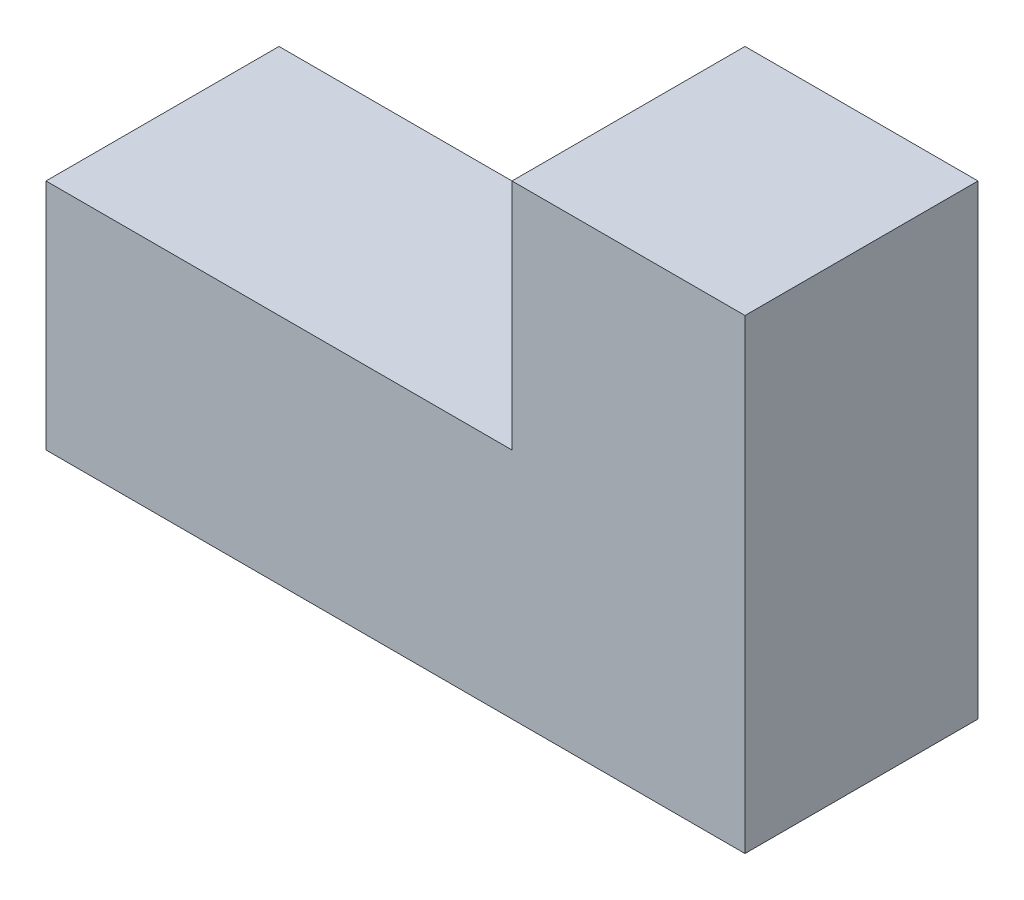
ISO-10303-21;
HEADER;
FILE_DESCRIPTION(('STEP AP214'),'2;1');
FILE_NAME('part.step','',(''),(''),'','','');
FILE_SCHEMA(('AUTOMOTIVE_DESIGN { 1 0 10303 214 1 1 1 1 }'));
ENDSEC;
DATA;
#1=APPLICATION_CONTEXT('core data for automotive mechanical design processes');
#2=APPLICATION_PROTOCOL_DEFINITION('international standard','automotive_design',2000,#1);
#3=PRODUCT_CONTEXT('',#1,'mechanical');
#4=PRODUCT('Part','Part','',(#3));
#5=PRODUCT_RELATED_PRODUCT_CATEGORY('part','',(#4));
#6=PRODUCT_DEFINITION_FORMATION('','',#4);
#7=PRODUCT_DEFINITION_CONTEXT('part definition',#1,'design');
#8=PRODUCT_DEFINITION('design','',#6,#7);
#9=PRODUCT_DEFINITION_SHAPE('','',#8);
#10=(LENGTH_UNIT() NAMED_UNIT(*) SI_UNIT(.MILLI.,.METRE.));
#11=(NAMED_UNIT(*) PLANE_ANGLE_UNIT() SI_UNIT($,.RADIAN.));
#12=(NAMED_UNIT(*) SI_UNIT($,.STERADIAN.) SOLID_ANGLE_UNIT());
#13=UNCERTAINTY_MEASURE_WITH_UNIT(LENGTH_MEASURE(1.E-05),#10,'distance_accuracy_value','');
#14=(GEOMETRIC_REPRESENTATION_CONTEXT(3) GLOBAL_UNCERTAINTY_ASSIGNED_CONTEXT((#13)) GLOBAL_UNIT_ASSIGNED_CONTEXT((#10,
#11,#12)) REPRESENTATION_CONTEXT('',''));
#15=CARTESIAN_POINT('',(0.,0.,0.));
#16=DIRECTION('',(0.,0.,1.));
#17=DIRECTION('',(1.,0.,0.));
#18=AXIS2_PLACEMENT_3D('',#15,#16,#17);
#19=CARTESIAN_POINT('',(-75.,30.,-30.));
#20=DIRECTION('',(-1.,0.,0.));
#21=DIRECTION('',(0.,0.,1.));
#22=AXIS2_PLACEMENT_3D('',#19,#20,#21);
#23=PLANE('',#22);
#24=DIRECTION('',(0.,-1.,0.));
#25=VECTOR('',#24,1.);
#26=CARTESIAN_POINT('',(-75.,30.,0.));
#27=LINE('',#26,#25);
#28=CARTESIAN_POINT('',(-75.,30.,0.));
#29=VERTEX_POINT('',#28);
#30=CARTESIAN_POINT('',(-75.,0.,0.));
#31=VERTEX_POINT('',#30);
#32=EDGE_CURVE('E118',#29,#31,#27,.T.);
#33=ORIENTED_EDGE('',*,*,#32,.F.);
#34=DIRECTION('',(0.,0.,1.));
#35=VECTOR('',#34,1.);
#36=CARTESIAN_POINT('',(-75.,30.,-30.));
#37=LINE('',#36,#35);
#38=CARTESIAN_POINT('',(-75.,30.,-30.));
#39=VERTEX_POINT('',#38);
#40=EDGE_CURVE('E11',#39,#29,#37,.T.);
#41=ORIENTED_EDGE('',*,*,#40,.F.);
#42=DIRECTION('',(0.,-1.,0.));
#43=VECTOR('',#42,1.);
#44=CARTESIAN_POINT('',(-75.,30.,-30.));
#45=LINE('',#44,#43);
#46=CARTESIAN_POINT('',(-75.,0.,-30.));
#47=VERTEX_POINT('',#46);
#48=EDGE_CURVE('E132',#39,#47,#45,.T.);
#49=ORIENTED_EDGE('',*,*,#48,.T.);
#50=DIRECTION('',(0.,0.,1.));
#51=VECTOR('',#50,1.);
#52=CARTESIAN_POINT('',(-75.,0.,-30.));
#53=LINE('',#52,#51);
#54=EDGE_CURVE('E36',#47,#31,#53,.T.);
#55=ORIENTED_EDGE('',*,*,#54,.T.);
#56=EDGE_LOOP('',(#33,#41,#49,#55));
#57=FACE_BOUND('',#56,.T.);
#58=ADVANCED_FACE('F33',(#57),#23,.T.);
#59=CARTESIAN_POINT('',(-15.,30.,-30.));
#60=DIRECTION('',(0.,1.,0.));
#61=DIRECTION('',(-1.,0.,0.));
#62=AXIS2_PLACEMENT_3D('',#59,#60,#61);
#63=PLANE('',#62);
#64=DIRECTION('',(-1.,0.,0.));
#65=VECTOR('',#64,1.);
#66=CARTESIAN_POINT('',(-15.,30.,0.));
#67=LINE('',#66,#65);
#68=CARTESIAN_POINT('',(-15.,30.,0.));
#69=VERTEX_POINT('',#68);
#70=EDGE_CURVE('E130',#69,#29,#67,.T.);
#71=ORIENTED_EDGE('',*,*,#70,.F.);
#72=DIRECTION('',(0.,0.,1.));
#73=VECTOR('',#72,1.);
#74=CARTESIAN_POINT('',(-15.,30.,-30.));
#75=LINE('',#74,#73);
#76=CARTESIAN_POINT('',(-15.,30.,-30.));
#77=VERTEX_POINT('',#76);
#78=EDGE_CURVE('E42',#77,#69,#75,.T.);
#79=ORIENTED_EDGE('',*,*,#78,.F.);
#80=DIRECTION('',(-1.,0.,0.));
#81=VECTOR('',#80,1.);
#82=CARTESIAN_POINT('',(-15.,30.,-30.));
#83=LINE('',#82,#81);
#84=EDGE_CURVE('E108',#77,#39,#83,.T.);
#85=ORIENTED_EDGE('',*,*,#84,.T.);
#86=ORIENTED_EDGE('',*,*,#40,.T.);
#87=EDGE_LOOP('',(#71,#79,#85,#86));
#88=FACE_BOUND('',#87,.T.);
#89=ADVANCED_FACE('F140',(#88),#63,.T.);
#90=CARTESIAN_POINT('',(-15.,60.,-30.));
#91=DIRECTION('',(-1.,0.,0.));
#92=DIRECTION('',(0.,-1.,0.));
#93=AXIS2_PLACEMENT_3D('',#90,#91,#92);
#94=PLANE('',#93);
#95=DIRECTION('',(0.,-1.,0.));
#96=VECTOR('',#95,1.);
#97=CARTESIAN_POINT('',(-15.,60.,0.));
#98=LINE('',#97,#96);
#99=CARTESIAN_POINT('',(-15.,60.,0.));
#100=VERTEX_POINT('',#99);
#101=EDGE_CURVE('E95',#100,#69,#98,.T.);
#102=ORIENTED_EDGE('',*,*,#101,.F.);
#103=DIRECTION('',(0.,0.,1.));
#104=VECTOR('',#103,1.);
#105=CARTESIAN_POINT('',(-15.,60.,-30.));
#106=LINE('',#105,#104);
#107=CARTESIAN_POINT('',(-15.,60.,-30.));
#108=VERTEX_POINT('',#107);
#109=EDGE_CURVE('E90',#108,#100,#106,.T.);
#110=ORIENTED_EDGE('',*,*,#109,.F.);
#111=DIRECTION('',(0.,-1.,0.));
#112=VECTOR('',#111,1.);
#113=CARTESIAN_POINT('',(-15.,60.,-30.));
#114=LINE('',#113,#112);
#115=EDGE_CURVE('E93',#108,#77,#114,.T.);
#116=ORIENTED_EDGE('',*,*,#115,.T.);
#117=ORIENTED_EDGE('',*,*,#78,.T.);
#118=EDGE_LOOP('',(#102,#110,#116,#117));
#119=FACE_BOUND('',#118,.T.);
#120=ADVANCED_FACE('F92',(#119),#94,.T.);
#121=CARTESIAN_POINT('',(15.,60.,-30.));
#122=DIRECTION('',(0.,1.,0.));
#123=DIRECTION('',(-1.,0.,0.));
#124=AXIS2_PLACEMENT_3D('',#121,#122,#123);
#125=PLANE('',#124);
#126=DIRECTION('',(-1.,0.,0.));
#127=VECTOR('',#126,1.);
#128=CARTESIAN_POINT('',(15.,60.,0.));
#129=LINE('',#128,#127);
#130=CARTESIAN_POINT('',(15.,60.,0.));
#131=VERTEX_POINT('',#130);
#132=EDGE_CURVE('E127',#131,#100,#129,.T.);
#133=ORIENTED_EDGE('',*,*,#132,.F.);
#134=DIRECTION('',(0.,0.,1.));
#135=VECTOR('',#134,1.);
#136=CARTESIAN_POINT('',(15.,60.,-30.));
#137=LINE('',#136,#135);
#138=CARTESIAN_POINT('',(15.,60.,-30.));
#139=VERTEX_POINT('',#138);
#140=EDGE_CURVE('E100',#139,#131,#137,.T.);
#141=ORIENTED_EDGE('',*,*,#140,.F.);
#142=DIRECTION('',(-1.,0.,0.));
#143=VECTOR('',#142,1.);
#144=CARTESIAN_POINT('',(15.,60.,-30.));
#145=LINE('',#144,#143);
#146=EDGE_CURVE('E106',#139,#108,#145,.T.);
#147=ORIENTED_EDGE('',*,*,#146,.T.);
#148=ORIENTED_EDGE('',*,*,#109,.T.);
#149=EDGE_LOOP('',(#133,#141,#147,#148));
#150=FACE_BOUND('',#149,.T.);
#151=ADVANCED_FACE('F110',(#150),#125,.T.);
#152=CARTESIAN_POINT('',(15.,0.,-30.));
#153=DIRECTION('',(1.,0.,0.));
#154=DIRECTION('',(0.,1.,0.));
#155=AXIS2_PLACEMENT_3D('',#152,#153,#154);
#156=PLANE('',#155);
#157=DIRECTION('',(0.,1.,0.));
#158=VECTOR('',#157,1.);
#159=CARTESIAN_POINT('',(15.,0.,0.));
#160=LINE('',#159,#158);
#161=CARTESIAN_POINT('',(15.,0.,0.));
#162=VERTEX_POINT('',#161);
#163=EDGE_CURVE('E124',#162,#131,#160,.T.);
#164=ORIENTED_EDGE('',*,*,#163,.F.);
#165=DIRECTION('',(0.,0.,1.));
#166=VECTOR('',#165,1.);
#167=CARTESIAN_POINT('',(15.,0.,-30.));
#168=LINE('',#167,#166);
#169=CARTESIAN_POINT('',(15.,0.,-30.));
#170=VERTEX_POINT('',#169);
#171=EDGE_CURVE('E135',#170,#162,#168,.T.);
#172=ORIENTED_EDGE('',*,*,#171,.F.);
#173=DIRECTION('',(0.,1.,0.));
#174=VECTOR('',#173,1.);
#175=CARTESIAN_POINT('',(15.,0.,-30.));
#176=LINE('',#175,#174);
#177=EDGE_CURVE('E111',#170,#139,#176,.T.);
#178=ORIENTED_EDGE('',*,*,#177,.T.);
#179=ORIENTED_EDGE('',*,*,#140,.T.);
#180=EDGE_LOOP('',(#164,#172,#178,#179));
#181=FACE_BOUND('',#180,.T.);
#182=ADVANCED_FACE('F153',(#181),#156,.T.);
#183=CARTESIAN_POINT('',(-75.,0.,-30.));
#184=DIRECTION('',(0.,-1.,0.));
#185=DIRECTION('',(1.,0.,0.));
#186=AXIS2_PLACEMENT_3D('',#183,#184,#185);
#187=PLANE('',#186);
#188=DIRECTION('',(1.,0.,0.));
#189=VECTOR('',#188,1.);
#190=CARTESIAN_POINT('',(-75.,0.,0.));
#191=LINE('',#190,#189);
#192=EDGE_CURVE('E121',#31,#162,#191,.T.);
#193=ORIENTED_EDGE('',*,*,#192,.F.);
#194=ORIENTED_EDGE('',*,*,#54,.F.);
#195=DIRECTION('',(1.,0.,0.));
#196=VECTOR('',#195,1.);
#197=CARTESIAN_POINT('',(-75.,0.,-30.));
#198=LINE('',#197,#196);
#199=EDGE_CURVE('E113',#47,#170,#198,.T.);
#200=ORIENTED_EDGE('',*,*,#199,.T.);
#201=ORIENTED_EDGE('',*,*,#171,.T.);
#202=EDGE_LOOP('',(#193,#194,#200,#201));
#203=FACE_BOUND('',#202,.T.);
#204=ADVANCED_FACE('F137',(#203),#187,.T.);
#205=CARTESIAN_POINT('',(0.,0.,-30.));
#206=DIRECTION('',(0.,0.,1.));
#207=DIRECTION('',(1.,0.,0.));
#208=AXIS2_PLACEMENT_3D('',#205,#206,#207);
#209=PLANE('',#208);
#210=ORIENTED_EDGE('',*,*,#48,.F.);
#211=ORIENTED_EDGE('',*,*,#84,.F.);
#212=ORIENTED_EDGE('',*,*,#115,.F.);
#213=ORIENTED_EDGE('',*,*,#146,.F.);
#214=ORIENTED_EDGE('',*,*,#177,.F.);
#215=ORIENTED_EDGE('',*,*,#199,.F.);
#216=EDGE_LOOP('',(#210,#211,#212,#213,#214,#215));
#217=FACE_BOUND('',#216,.T.);
#218=ADVANCED_FACE('F104',(#217),#209,.F.);
#219=CARTESIAN_POINT('',(0.,0.,0.));
#220=DIRECTION('',(0.,0.,1.));
#221=DIRECTION('',(1.,0.,0.));
#222=AXIS2_PLACEMENT_3D('',#219,#220,#221);
#223=PLANE('',#222);
#224=ORIENTED_EDGE('',*,*,#32,.T.);
#225=ORIENTED_EDGE('',*,*,#192,.T.);
#226=ORIENTED_EDGE('',*,*,#163,.T.);
#227=ORIENTED_EDGE('',*,*,#132,.T.);
#228=ORIENTED_EDGE('',*,*,#101,.T.);
#229=ORIENTED_EDGE('',*,*,#70,.T.);
#230=EDGE_LOOP('',(#224,#225,#226,#227,#228,#229));
#231=FACE_BOUND('',#230,.T.);
#232=ADVANCED_FACE('F139',(#231),#223,.T.);
#233=CLOSED_SHELL('',(#58,#89,#120,#151,#182,#204,#218,#232));
#234=MANIFOLD_SOLID_BREP('B2',#233);
#235=ADVANCED_BREP_SHAPE_REPRESENTATION('',(#18,#234),#14);
#236=SHAPE_DEFINITION_REPRESENTATION(#9,#235);
ENDSEC;
END-ISO-10303-21;
